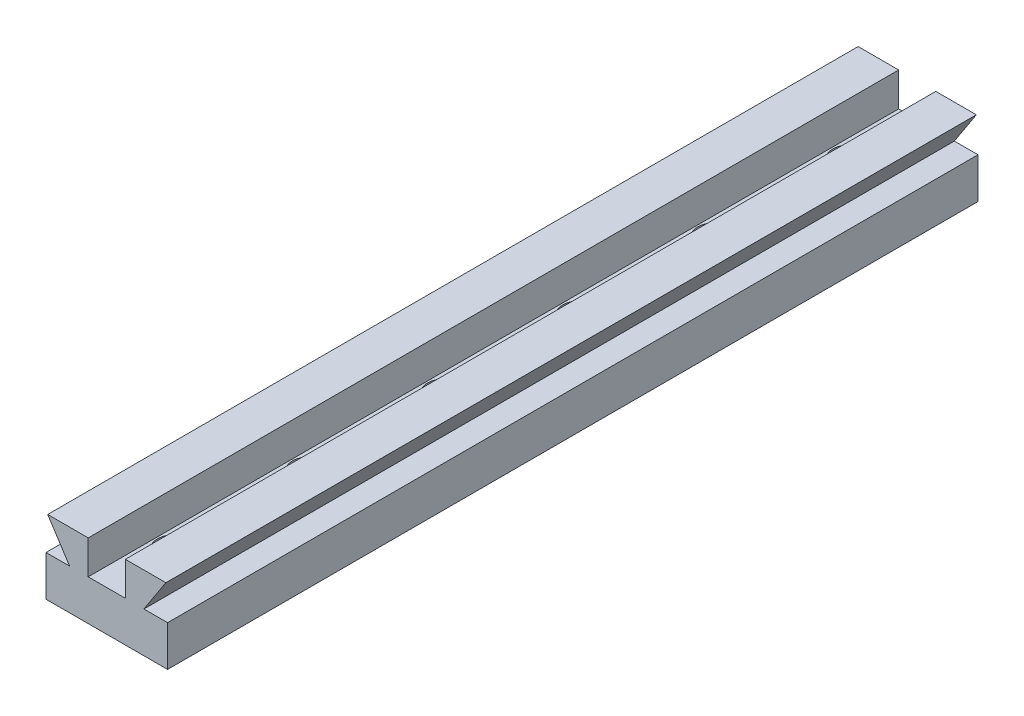
ISO-10303-21;
HEADER;
FILE_DESCRIPTION(('STEP AP214'),'2;1');
FILE_NAME('part.step','',(''),(''),'','','');
FILE_SCHEMA(('AUTOMOTIVE_DESIGN { 1 0 10303 214 1 1 1 1 }'));
ENDSEC;
DATA;
#1=APPLICATION_CONTEXT('core data for automotive mechanical design processes');
#2=APPLICATION_PROTOCOL_DEFINITION('international standard','automotive_design',2000,#1);
#3=PRODUCT_CONTEXT('',#1,'mechanical');
#4=PRODUCT('Part','Part','',(#3));
#5=PRODUCT_RELATED_PRODUCT_CATEGORY('part','',(#4));
#6=PRODUCT_DEFINITION_FORMATION('','',#4);
#7=PRODUCT_DEFINITION_CONTEXT('part definition',#1,'design');
#8=PRODUCT_DEFINITION('design','',#6,#7);
#9=PRODUCT_DEFINITION_SHAPE('','',#8);
#10=(LENGTH_UNIT() NAMED_UNIT(*) SI_UNIT(.MILLI.,.METRE.));
#11=(NAMED_UNIT(*) PLANE_ANGLE_UNIT() SI_UNIT($,.RADIAN.));
#12=(NAMED_UNIT(*) SI_UNIT($,.STERADIAN.) SOLID_ANGLE_UNIT());
#13=UNCERTAINTY_MEASURE_WITH_UNIT(LENGTH_MEASURE(1.E-05),#10,'distance_accuracy_value','');
#14=(GEOMETRIC_REPRESENTATION_CONTEXT(3) GLOBAL_UNCERTAINTY_ASSIGNED_CONTEXT((#13)) GLOBAL_UNIT_ASSIGNED_CONTEXT((#10,
#11,#12)) REPRESENTATION_CONTEXT('',''));
#15=CARTESIAN_POINT('',(0.,0.,0.));
#16=DIRECTION('',(0.,0.,1.));
#17=DIRECTION('',(1.,0.,0.));
#18=AXIS2_PLACEMENT_3D('',#15,#16,#17);
#19=CARTESIAN_POINT('',(-6.35016286644951,-3.58631921824104,120.));
#20=DIRECTION('',(0.838443616300637,0.544988350595414,0.));
#21=DIRECTION('',(-0.544988350595414,0.838443616300637,0.));
#22=AXIS2_PLACEMENT_3D('',#19,#20,#21);
#23=PLANE('',#22);
#24=DIRECTION('',(0.544988350595414,-0.838443616300637,0.));
#25=VECTOR('',#24,1.);
#26=CARTESIAN_POINT('',(-6.35016286644951,-3.58631921824104,0.));
#27=LINE('',#26,#25);
#28=CARTESIAN_POINT('',(-9.60016286644951,1.41368078175896,0.));
#29=VERTEX_POINT('',#28);
#30=CARTESIAN_POINT('',(-6.35016286644951,-3.58631921824104,0.));
#31=VERTEX_POINT('',#30);
#32=EDGE_CURVE('E153',#29,#31,#27,.T.);
#33=ORIENTED_EDGE('',*,*,#32,.T.);
#34=DIRECTION('',(0.,0.,-1.));
#35=VECTOR('',#34,1.);
#36=CARTESIAN_POINT('',(-6.35016286644951,-3.58631921824104,120.));
#37=LINE('',#36,#35);
#38=CARTESIAN_POINT('',(-6.35016286644951,-3.58631921824104,120.));
#39=VERTEX_POINT('',#38);
#40=EDGE_CURVE('E11',#39,#31,#37,.T.);
#41=ORIENTED_EDGE('',*,*,#40,.F.);
#42=DIRECTION('',(0.544988350595414,-0.838443616300637,0.));
#43=VECTOR('',#42,1.);
#44=CARTESIAN_POINT('',(-6.35016286644951,-3.58631921824104,120.));
#45=LINE('',#44,#43);
#46=CARTESIAN_POINT('',(-9.60016286644951,1.41368078175896,120.));
#47=VERTEX_POINT('',#46);
#48=EDGE_CURVE('E176',#47,#39,#45,.T.);
#49=ORIENTED_EDGE('',*,*,#48,.F.);
#50=DIRECTION('',(0.,0.,-1.));
#51=VECTOR('',#50,1.);
#52=CARTESIAN_POINT('',(-9.60016286644951,1.41368078175896,120.));
#53=LINE('',#52,#51);
#54=EDGE_CURVE('E149',#47,#29,#53,.T.);
#55=ORIENTED_EDGE('',*,*,#54,.T.);
#56=EDGE_LOOP('',(#33,#41,#49,#55));
#57=FACE_BOUND('',#56,.T.);
#58=ADVANCED_FACE('F33',(#57),#23,.F.);
#59=CARTESIAN_POINT('',(-9.85016286644951,-3.58631921824104,120.));
#60=DIRECTION('',(0.,-1.,0.));
#61=DIRECTION('',(1.,0.,0.));
#62=AXIS2_PLACEMENT_3D('',#59,#60,#61);
#63=PLANE('',#62);
#64=DIRECTION('',(-1.,0.,0.));
#65=VECTOR('',#64,1.);
#66=CARTESIAN_POINT('',(-9.85016286644951,-3.58631921824104,0.));
#67=LINE('',#66,#65);
#68=CARTESIAN_POINT('',(-9.85016286644951,-3.58631921824104,0.));
#69=VERTEX_POINT('',#68);
#70=EDGE_CURVE('E156',#31,#69,#67,.T.);
#71=ORIENTED_EDGE('',*,*,#70,.T.);
#72=DIRECTION('',(0.,0.,-1.));
#73=VECTOR('',#72,1.);
#74=CARTESIAN_POINT('',(-9.85016286644951,-3.58631921824104,120.));
#75=LINE('',#74,#73);
#76=CARTESIAN_POINT('',(-9.85016286644951,-3.58631921824104,120.));
#77=VERTEX_POINT('',#76);
#78=EDGE_CURVE('E41',#77,#69,#75,.T.);
#79=ORIENTED_EDGE('',*,*,#78,.F.);
#80=DIRECTION('',(-1.,0.,0.));
#81=VECTOR('',#80,1.);
#82=CARTESIAN_POINT('',(-9.85016286644951,-3.58631921824104,120.));
#83=LINE('',#82,#81);
#84=EDGE_CURVE('E104',#39,#77,#83,.T.);
#85=ORIENTED_EDGE('',*,*,#84,.F.);
#86=ORIENTED_EDGE('',*,*,#40,.T.);
#87=EDGE_LOOP('',(#71,#79,#85,#86));
#88=FACE_BOUND('',#87,.T.);
#89=ADVANCED_FACE('F254',(#88),#63,.F.);
#90=CARTESIAN_POINT('',(-9.85016286644951,-9.58631921824104,120.));
#91=DIRECTION('',(1.,0.,0.));
#92=DIRECTION('',(0.,0.,-1.));
#93=AXIS2_PLACEMENT_3D('',#90,#91,#92);
#94=PLANE('',#93);
#95=DIRECTION('',(0.,-1.,0.));
#96=VECTOR('',#95,1.);
#97=CARTESIAN_POINT('',(-9.85016286644951,-9.58631921824104,0.));
#98=LINE('',#97,#96);
#99=CARTESIAN_POINT('',(-9.85016286644951,-9.58631921824104,0.));
#100=VERTEX_POINT('',#99);
#101=EDGE_CURVE('E159',#69,#100,#98,.T.);
#102=ORIENTED_EDGE('',*,*,#101,.T.);
#103=DIRECTION('',(0.,0.,-1.));
#104=VECTOR('',#103,1.);
#105=CARTESIAN_POINT('',(-9.85016286644951,-9.58631921824104,120.));
#106=LINE('',#105,#104);
#107=CARTESIAN_POINT('',(-9.85016286644951,-9.58631921824104,120.));
#108=VERTEX_POINT('',#107);
#109=EDGE_CURVE('E195',#108,#100,#106,.T.);
#110=ORIENTED_EDGE('',*,*,#109,.F.);
#111=DIRECTION('',(0.,-1.,0.));
#112=VECTOR('',#111,1.);
#113=CARTESIAN_POINT('',(-9.85016286644951,-9.58631921824104,120.));
#114=LINE('',#113,#112);
#115=EDGE_CURVE('E203',#77,#108,#114,.T.);
#116=ORIENTED_EDGE('',*,*,#115,.F.);
#117=ORIENTED_EDGE('',*,*,#78,.T.);
#118=EDGE_LOOP('',(#102,#110,#116,#117));
#119=FACE_BOUND('',#118,.T.);
#120=ADVANCED_FACE('F201',(#119),#94,.F.);
#121=CARTESIAN_POINT('',(8.14983713355049,-9.58631921824104,120.));
#122=DIRECTION('',(0.,1.,0.));
#123=DIRECTION('',(0.,0.,1.));
#124=AXIS2_PLACEMENT_3D('',#121,#122,#123);
#125=PLANE('',#124);
#126=CARTESIAN_POINT('',(-0.850162866449506,-9.58631921824104,30.));
#127=DIRECTION('',(0.,1.,0.));
#128=DIRECTION('',(0.,0.,1.));
#129=AXIS2_PLACEMENT_3D('',#126,#127,#128);
#130=CIRCLE('',#129,1.5);
#131=CARTESIAN_POINT('',(-0.850162866449506,-9.58631921824104,31.5));
#132=VERTEX_POINT('',#131);
#133=EDGE_CURVE('E338',#132,#132,#130,.T.);
#134=ORIENTED_EDGE('',*,*,#133,.T.);
#135=EDGE_LOOP('',(#134));
#136=FACE_BOUND('',#135,.T.);
#137=CARTESIAN_POINT('',(-0.850162866449506,-9.58631921824104,50.));
#138=DIRECTION('',(0.,1.,0.));
#139=DIRECTION('',(0.,0.,1.));
#140=AXIS2_PLACEMENT_3D('',#137,#138,#139);
#141=CIRCLE('',#140,1.5);
#142=CARTESIAN_POINT('',(-0.850162866449506,-9.58631921824104,51.5));
#143=VERTEX_POINT('',#142);
#144=EDGE_CURVE('E362',#143,#143,#141,.T.);
#145=ORIENTED_EDGE('',*,*,#144,.T.);
#146=EDGE_LOOP('',(#145));
#147=FACE_BOUND('',#146,.T.);
#148=CARTESIAN_POINT('',(-0.850162866449506,-9.58631921824104,70.));
#149=DIRECTION('',(0.,1.,0.));
#150=DIRECTION('',(0.,0.,1.));
#151=AXIS2_PLACEMENT_3D('',#148,#149,#150);
#152=CIRCLE('',#151,1.5);
#153=CARTESIAN_POINT('',(-0.850162866449506,-9.58631921824104,71.5));
#154=VERTEX_POINT('',#153);
#155=EDGE_CURVE('E356',#154,#154,#152,.T.);
#156=ORIENTED_EDGE('',*,*,#155,.T.);
#157=EDGE_LOOP('',(#156));
#158=FACE_BOUND('',#157,.T.);
#159=CARTESIAN_POINT('',(-0.850162866449506,-9.58631921824104,90.));
#160=DIRECTION('',(0.,1.,0.));
#161=DIRECTION('',(0.,0.,1.));
#162=AXIS2_PLACEMENT_3D('',#159,#160,#161);
#163=CIRCLE('',#162,1.5);
#164=CARTESIAN_POINT('',(-0.850162866449506,-9.58631921824104,91.5));
#165=VERTEX_POINT('',#164);
#166=EDGE_CURVE('E350',#165,#165,#163,.T.);
#167=ORIENTED_EDGE('',*,*,#166,.T.);
#168=EDGE_LOOP('',(#167));
#169=FACE_BOUND('',#168,.T.);
#170=CARTESIAN_POINT('',(-0.850162866449506,-9.58631921824104,110.));
#171=DIRECTION('',(0.,1.,0.));
#172=DIRECTION('',(0.,0.,1.));
#173=AXIS2_PLACEMENT_3D('',#170,#171,#172);
#174=CIRCLE('',#173,1.5);
#175=CARTESIAN_POINT('',(-0.850162866449506,-9.58631921824104,111.5));
#176=VERTEX_POINT('',#175);
#177=EDGE_CURVE('E344',#176,#176,#174,.T.);
#178=ORIENTED_EDGE('',*,*,#177,.T.);
#179=EDGE_LOOP('',(#178));
#180=FACE_BOUND('',#179,.T.);
#181=CARTESIAN_POINT('',(-0.850162866449506,-9.58631921824104,10.));
#182=DIRECTION('',(0.,1.,0.));
#183=DIRECTION('',(0.,0.,1.));
#184=AXIS2_PLACEMENT_3D('',#181,#182,#183);
#185=CIRCLE('',#184,1.5);
#186=CARTESIAN_POINT('',(-0.850162866449506,-9.58631921824104,11.5));
#187=VERTEX_POINT('',#186);
#188=EDGE_CURVE('E319',#187,#187,#185,.T.);
#189=ORIENTED_EDGE('',*,*,#188,.T.);
#190=EDGE_LOOP('',(#189));
#191=FACE_BOUND('',#190,.T.);
#192=DIRECTION('',(1.,0.,0.));
#193=VECTOR('',#192,1.);
#194=CARTESIAN_POINT('',(8.14983713355049,-9.58631921824104,0.));
#195=LINE('',#194,#193);
#196=CARTESIAN_POINT('',(8.14983713355049,-9.58631921824104,0.));
#197=VERTEX_POINT('',#196);
#198=EDGE_CURVE('E161',#100,#197,#195,.T.);
#199=ORIENTED_EDGE('',*,*,#198,.T.);
#200=DIRECTION('',(0.,0.,-1.));
#201=VECTOR('',#200,1.);
#202=CARTESIAN_POINT('',(8.14983713355049,-9.58631921824104,120.));
#203=LINE('',#202,#201);
#204=CARTESIAN_POINT('',(8.14983713355049,-9.58631921824104,120.));
#205=VERTEX_POINT('',#204);
#206=EDGE_CURVE('E192',#205,#197,#203,.T.);
#207=ORIENTED_EDGE('',*,*,#206,.F.);
#208=DIRECTION('',(1.,0.,0.));
#209=VECTOR('',#208,1.);
#210=CARTESIAN_POINT('',(8.14983713355049,-9.58631921824104,120.));
#211=LINE('',#210,#209);
#212=EDGE_CURVE('E221',#108,#205,#211,.T.);
#213=ORIENTED_EDGE('',*,*,#212,.F.);
#214=ORIENTED_EDGE('',*,*,#109,.T.);
#215=EDGE_LOOP('',(#199,#207,#213,#214));
#216=FACE_BOUND('',#215,.T.);
#217=ADVANCED_FACE('F212',(#136,#147,#158,#169,#180,#191,#216),#125,.F.);
#218=CARTESIAN_POINT('',(8.14983713355049,-3.58631921824104,120.));
#219=DIRECTION('',(-1.,0.,0.));
#220=DIRECTION('',(0.,0.,1.));
#221=AXIS2_PLACEMENT_3D('',#218,#219,#220);
#222=PLANE('',#221);
#223=DIRECTION('',(0.,1.,0.));
#224=VECTOR('',#223,1.);
#225=CARTESIAN_POINT('',(8.14983713355049,-3.58631921824104,0.));
#226=LINE('',#225,#224);
#227=CARTESIAN_POINT('',(8.14983713355049,-3.58631921824104,0.));
#228=VERTEX_POINT('',#227);
#229=EDGE_CURVE('E163',#197,#228,#226,.T.);
#230=ORIENTED_EDGE('',*,*,#229,.T.);
#231=DIRECTION('',(0.,0.,-1.));
#232=VECTOR('',#231,1.);
#233=CARTESIAN_POINT('',(8.14983713355049,-3.58631921824104,120.));
#234=LINE('',#233,#232);
#235=CARTESIAN_POINT('',(8.14983713355049,-3.58631921824104,120.));
#236=VERTEX_POINT('',#235);
#237=EDGE_CURVE('E189',#236,#228,#234,.T.);
#238=ORIENTED_EDGE('',*,*,#237,.F.);
#239=DIRECTION('',(0.,1.,0.));
#240=VECTOR('',#239,1.);
#241=CARTESIAN_POINT('',(8.14983713355049,-3.58631921824104,120.));
#242=LINE('',#241,#240);
#243=EDGE_CURVE('E218',#205,#236,#242,.T.);
#244=ORIENTED_EDGE('',*,*,#243,.F.);
#245=ORIENTED_EDGE('',*,*,#206,.T.);
#246=EDGE_LOOP('',(#230,#238,#244,#245));
#247=FACE_BOUND('',#246,.T.);
#248=ADVANCED_FACE('F216',(#247),#222,.F.);
#249=CARTESIAN_POINT('',(4.64983713355049,-3.58631921824104,120.));
#250=DIRECTION('',(0.,-1.,0.));
#251=DIRECTION('',(0.,0.,-1.));
#252=AXIS2_PLACEMENT_3D('',#249,#250,#251);
#253=PLANE('',#252);
#254=DIRECTION('',(-1.,0.,0.));
#255=VECTOR('',#254,1.);
#256=CARTESIAN_POINT('',(4.64983713355049,-3.58631921824104,0.));
#257=LINE('',#256,#255);
#258=CARTESIAN_POINT('',(4.64983713355049,-3.58631921824104,0.));
#259=VERTEX_POINT('',#258);
#260=EDGE_CURVE('E165',#228,#259,#257,.T.);
#261=ORIENTED_EDGE('',*,*,#260,.T.);
#262=DIRECTION('',(0.,0.,-1.));
#263=VECTOR('',#262,1.);
#264=CARTESIAN_POINT('',(4.64983713355049,-3.58631921824104,120.));
#265=LINE('',#264,#263);
#266=CARTESIAN_POINT('',(4.64983713355049,-3.58631921824104,120.));
#267=VERTEX_POINT('',#266);
#268=EDGE_CURVE('E186',#267,#259,#265,.T.);
#269=ORIENTED_EDGE('',*,*,#268,.F.);
#270=DIRECTION('',(-1.,0.,0.));
#271=VECTOR('',#270,1.);
#272=CARTESIAN_POINT('',(4.64983713355049,-3.58631921824104,120.));
#273=LINE('',#272,#271);
#274=EDGE_CURVE('E220',#236,#267,#273,.T.);
#275=ORIENTED_EDGE('',*,*,#274,.F.);
#276=ORIENTED_EDGE('',*,*,#237,.T.);
#277=EDGE_LOOP('',(#261,#269,#275,#276));
#278=FACE_BOUND('',#277,.T.);
#279=ADVANCED_FACE('F268',(#278),#253,.F.);
#280=CARTESIAN_POINT('',(7.89983713355049,1.41368078175896,120.));
#281=DIRECTION('',(-0.838443616300637,0.544988350595414,0.));
#282=DIRECTION('',(-0.544988350595414,-0.838443616300637,0.));
#283=AXIS2_PLACEMENT_3D('',#280,#281,#282);
#284=PLANE('',#283);
#285=DIRECTION('',(0.544988350595414,0.838443616300637,0.));
#286=VECTOR('',#285,1.);
#287=CARTESIAN_POINT('',(7.89983713355049,1.41368078175896,0.));
#288=LINE('',#287,#286);
#289=CARTESIAN_POINT('',(7.89983713355049,1.41368078175896,0.));
#290=VERTEX_POINT('',#289);
#291=EDGE_CURVE('E167',#259,#290,#288,.T.);
#292=ORIENTED_EDGE('',*,*,#291,.T.);
#293=DIRECTION('',(0.,0.,-1.));
#294=VECTOR('',#293,1.);
#295=CARTESIAN_POINT('',(7.89983713355049,1.41368078175896,120.));
#296=LINE('',#295,#294);
#297=CARTESIAN_POINT('',(7.89983713355049,1.41368078175896,120.));
#298=VERTEX_POINT('',#297);
#299=EDGE_CURVE('E183',#298,#290,#296,.T.);
#300=ORIENTED_EDGE('',*,*,#299,.F.);
#301=DIRECTION('',(0.544988350595414,0.838443616300637,0.));
#302=VECTOR('',#301,1.);
#303=CARTESIAN_POINT('',(7.89983713355049,1.41368078175896,120.));
#304=LINE('',#303,#302);
#305=EDGE_CURVE('E223',#267,#298,#304,.T.);
#306=ORIENTED_EDGE('',*,*,#305,.F.);
#307=ORIENTED_EDGE('',*,*,#268,.T.);
#308=EDGE_LOOP('',(#292,#300,#306,#307));
#309=FACE_BOUND('',#308,.T.);
#310=ADVANCED_FACE('F271',(#309),#284,.F.);
#311=CARTESIAN_POINT('',(1.89983713355049,1.41368078175896,120.));
#312=DIRECTION('',(0.,-1.,0.));
#313=DIRECTION('',(0.,0.,-1.));
#314=AXIS2_PLACEMENT_3D('',#311,#312,#313);
#315=PLANE('',#314);
#316=DIRECTION('',(-1.,0.,0.));
#317=VECTOR('',#316,1.);
#318=CARTESIAN_POINT('',(1.89983713355049,1.41368078175896,0.));
#319=LINE('',#318,#317);
#320=CARTESIAN_POINT('',(1.89983713355049,1.41368078175896,0.));
#321=VERTEX_POINT('',#320);
#322=EDGE_CURVE('E169',#290,#321,#319,.T.);
#323=ORIENTED_EDGE('',*,*,#322,.T.);
#324=DIRECTION('',(0.,0.,-1.));
#325=VECTOR('',#324,1.);
#326=CARTESIAN_POINT('',(1.89983713355049,1.41368078175896,120.));
#327=LINE('',#326,#325);
#328=CARTESIAN_POINT('',(1.89983713355049,1.41368078175896,120.));
#329=VERTEX_POINT('',#328);
#330=EDGE_CURVE('E180',#329,#321,#327,.T.);
#331=ORIENTED_EDGE('',*,*,#330,.F.);
#332=DIRECTION('',(-1.,0.,0.));
#333=VECTOR('',#332,1.);
#334=CARTESIAN_POINT('',(1.89983713355049,1.41368078175896,120.));
#335=LINE('',#334,#333);
#336=EDGE_CURVE('E229',#298,#329,#335,.T.);
#337=ORIENTED_EDGE('',*,*,#336,.F.);
#338=ORIENTED_EDGE('',*,*,#299,.T.);
#339=EDGE_LOOP('',(#323,#331,#337,#338));
#340=FACE_BOUND('',#339,.T.);
#341=ADVANCED_FACE('F235',(#340),#315,.F.);
#342=CARTESIAN_POINT('',(1.89983713355049,-3.58631921824104,120.));
#343=DIRECTION('',(1.,0.,0.));
#344=DIRECTION('',(0.,1.,0.));
#345=AXIS2_PLACEMENT_3D('',#342,#343,#344);
#346=PLANE('',#345);
#347=DIRECTION('',(0.,-1.,0.));
#348=VECTOR('',#347,1.);
#349=CARTESIAN_POINT('',(1.89983713355049,-3.58631921824104,0.));
#350=LINE('',#349,#348);
#351=CARTESIAN_POINT('',(1.89983713355049,-3.58631921824104,0.));
#352=VERTEX_POINT('',#351);
#353=EDGE_CURVE('E171',#321,#352,#350,.T.);
#354=ORIENTED_EDGE('',*,*,#353,.T.);
#355=DIRECTION('',(0.,0.,-1.));
#356=VECTOR('',#355,1.);
#357=CARTESIAN_POINT('',(1.89983713355049,-3.58631921824104,120.));
#358=LINE('',#357,#356);
#359=CARTESIAN_POINT('',(1.89983713355049,-3.58631921824104,120.));
#360=VERTEX_POINT('',#359);
#361=EDGE_CURVE('E144',#360,#352,#358,.T.);
#362=ORIENTED_EDGE('',*,*,#361,.F.);
#363=DIRECTION('',(0.,-1.,0.));
#364=VECTOR('',#363,1.);
#365=CARTESIAN_POINT('',(1.89983713355049,-3.58631921824104,120.));
#366=LINE('',#365,#364);
#367=EDGE_CURVE('E135',#329,#360,#366,.T.);
#368=ORIENTED_EDGE('',*,*,#367,.F.);
#369=ORIENTED_EDGE('',*,*,#330,.T.);
#370=EDGE_LOOP('',(#354,#362,#368,#369));
#371=FACE_BOUND('',#370,.T.);
#372=ADVANCED_FACE('F239',(#371),#346,.F.);
#373=CARTESIAN_POINT('',(-3.60016286644951,-3.58631921824104,120.));
#374=DIRECTION('',(0.,-1.,0.));
#375=DIRECTION('',(0.,0.,-1.));
#376=AXIS2_PLACEMENT_3D('',#373,#374,#375);
#377=PLANE('',#376);
#378=CARTESIAN_POINT('',(-0.850162866449506,-3.58631921824104,30.));
#379=DIRECTION('',(0.,1.,0.));
#380=DIRECTION('',(0.,0.,1.));
#381=AXIS2_PLACEMENT_3D('',#378,#379,#380);
#382=CIRCLE('',#381,2.5);
#383=CARTESIAN_POINT('',(-0.850162866449506,-3.58631921824104,32.5));
#384=VERTEX_POINT('',#383);
#385=EDGE_CURVE('E287',#384,#384,#382,.T.);
#386=ORIENTED_EDGE('',*,*,#385,.F.);
#387=EDGE_LOOP('',(#386));
#388=FACE_BOUND('',#387,.T.);
#389=CARTESIAN_POINT('',(-0.850162866449506,-3.58631921824104,50.));
#390=DIRECTION('',(0.,1.,0.));
#391=DIRECTION('',(0.,0.,1.));
#392=AXIS2_PLACEMENT_3D('',#389,#390,#391);
#393=CIRCLE('',#392,2.5);
#394=CARTESIAN_POINT('',(-0.850162866449506,-3.58631921824104,52.5));
#395=VERTEX_POINT('',#394);
#396=EDGE_CURVE('E291',#395,#395,#393,.T.);
#397=ORIENTED_EDGE('',*,*,#396,.F.);
#398=EDGE_LOOP('',(#397));
#399=FACE_BOUND('',#398,.T.);
#400=CARTESIAN_POINT('',(-0.850162866449506,-3.58631921824104,70.));
#401=DIRECTION('',(0.,1.,0.));
#402=DIRECTION('',(0.,0.,1.));
#403=AXIS2_PLACEMENT_3D('',#400,#401,#402);
#404=CIRCLE('',#403,2.5);
#405=CARTESIAN_POINT('',(-0.850162866449506,-3.58631921824104,72.5));
#406=VERTEX_POINT('',#405);
#407=EDGE_CURVE('E295',#406,#406,#404,.T.);
#408=ORIENTED_EDGE('',*,*,#407,.F.);
#409=EDGE_LOOP('',(#408));
#410=FACE_BOUND('',#409,.T.);
#411=CARTESIAN_POINT('',(-0.850162866449506,-3.58631921824104,90.));
#412=DIRECTION('',(0.,1.,0.));
#413=DIRECTION('',(0.,0.,1.));
#414=AXIS2_PLACEMENT_3D('',#411,#412,#413);
#415=CIRCLE('',#414,2.5);
#416=CARTESIAN_POINT('',(-0.850162866449506,-3.58631921824104,92.5));
#417=VERTEX_POINT('',#416);
#418=EDGE_CURVE('E299',#417,#417,#415,.T.);
#419=ORIENTED_EDGE('',*,*,#418,.F.);
#420=EDGE_LOOP('',(#419));
#421=FACE_BOUND('',#420,.T.);
#422=CARTESIAN_POINT('',(-0.850162866449506,-3.58631921824104,110.));
#423=DIRECTION('',(0.,1.,0.));
#424=DIRECTION('',(0.,0.,1.));
#425=AXIS2_PLACEMENT_3D('',#422,#423,#424);
#426=CIRCLE('',#425,2.5);
#427=CARTESIAN_POINT('',(-0.850162866449506,-3.58631921824104,112.5));
#428=VERTEX_POINT('',#427);
#429=EDGE_CURVE('E303',#428,#428,#426,.T.);
#430=ORIENTED_EDGE('',*,*,#429,.F.);
#431=EDGE_LOOP('',(#430));
#432=FACE_BOUND('',#431,.T.);
#433=CARTESIAN_POINT('',(-0.850162866449506,-3.58631921824104,10.));
#434=DIRECTION('',(0.,1.,0.));
#435=DIRECTION('',(0.,0.,1.));
#436=AXIS2_PLACEMENT_3D('',#433,#434,#435);
#437=CIRCLE('',#436,2.5);
#438=CARTESIAN_POINT('',(-0.850162866449506,-3.58631921824104,12.5));
#439=VERTEX_POINT('',#438);
#440=EDGE_CURVE('E306',#439,#439,#437,.T.);
#441=ORIENTED_EDGE('',*,*,#440,.F.);
#442=EDGE_LOOP('',(#441));
#443=FACE_BOUND('',#442,.T.);
#444=DIRECTION('',(-1.,0.,0.));
#445=VECTOR('',#444,1.);
#446=CARTESIAN_POINT('',(-3.60016286644951,-3.58631921824104,0.));
#447=LINE('',#446,#445);
#448=CARTESIAN_POINT('',(-3.60016286644951,-3.58631921824104,0.));
#449=VERTEX_POINT('',#448);
#450=EDGE_CURVE('E143',#352,#449,#447,.T.);
#451=ORIENTED_EDGE('',*,*,#450,.T.);
#452=DIRECTION('',(0.,0.,-1.));
#453=VECTOR('',#452,1.);
#454=CARTESIAN_POINT('',(-3.60016286644951,-3.58631921824104,120.));
#455=LINE('',#454,#453);
#456=CARTESIAN_POINT('',(-3.60016286644951,-3.58631921824104,120.));
#457=VERTEX_POINT('',#456);
#458=EDGE_CURVE('E140',#457,#449,#455,.T.);
#459=ORIENTED_EDGE('',*,*,#458,.F.);
#460=DIRECTION('',(-1.,0.,0.));
#461=VECTOR('',#460,1.);
#462=CARTESIAN_POINT('',(-3.60016286644951,-3.58631921824104,120.));
#463=LINE('',#462,#461);
#464=EDGE_CURVE('E129',#360,#457,#463,.T.);
#465=ORIENTED_EDGE('',*,*,#464,.F.);
#466=ORIENTED_EDGE('',*,*,#361,.T.);
#467=EDGE_LOOP('',(#451,#459,#465,#466));
#468=FACE_BOUND('',#467,.T.);
#469=ADVANCED_FACE('F141',(#388,#399,#410,#421,#432,#443,#468),#377,.F.);
#470=CARTESIAN_POINT('',(-3.60016286644951,1.41368078175896,120.));
#471=DIRECTION('',(-1.,0.,0.));
#472=DIRECTION('',(0.,-1.,0.));
#473=AXIS2_PLACEMENT_3D('',#470,#471,#472);
#474=PLANE('',#473);
#475=DIRECTION('',(0.,1.,0.));
#476=VECTOR('',#475,1.);
#477=CARTESIAN_POINT('',(-3.60016286644951,1.41368078175896,0.));
#478=LINE('',#477,#476);
#479=CARTESIAN_POINT('',(-3.60016286644951,1.41368078175896,0.));
#480=VERTEX_POINT('',#479);
#481=EDGE_CURVE('E90',#449,#480,#478,.T.);
#482=ORIENTED_EDGE('',*,*,#481,.T.);
#483=DIRECTION('',(0.,0.,-1.));
#484=VECTOR('',#483,1.);
#485=CARTESIAN_POINT('',(-3.60016286644951,1.41368078175896,120.));
#486=LINE('',#485,#484);
#487=CARTESIAN_POINT('',(-3.60016286644951,1.41368078175896,120.));
#488=VERTEX_POINT('',#487);
#489=EDGE_CURVE('E145',#488,#480,#486,.T.);
#490=ORIENTED_EDGE('',*,*,#489,.F.);
#491=DIRECTION('',(0.,1.,0.));
#492=VECTOR('',#491,1.);
#493=CARTESIAN_POINT('',(-3.60016286644951,1.41368078175896,120.));
#494=LINE('',#493,#492);
#495=EDGE_CURVE('E133',#457,#488,#494,.T.);
#496=ORIENTED_EDGE('',*,*,#495,.F.);
#497=ORIENTED_EDGE('',*,*,#458,.T.);
#498=EDGE_LOOP('',(#482,#490,#496,#497));
#499=FACE_BOUND('',#498,.T.);
#500=ADVANCED_FACE('F147',(#499),#474,.F.);
#501=CARTESIAN_POINT('',(-9.60016286644951,1.41368078175896,120.));
#502=DIRECTION('',(0.,-1.,0.));
#503=DIRECTION('',(0.,0.,-1.));
#504=AXIS2_PLACEMENT_3D('',#501,#502,#503);
#505=PLANE('',#504);
#506=DIRECTION('',(-1.,0.,0.));
#507=VECTOR('',#506,1.);
#508=CARTESIAN_POINT('',(-9.60016286644951,1.41368078175896,0.));
#509=LINE('',#508,#507);
#510=EDGE_CURVE('E96',#480,#29,#509,.T.);
#511=ORIENTED_EDGE('',*,*,#510,.T.);
#512=ORIENTED_EDGE('',*,*,#54,.F.);
#513=DIRECTION('',(-1.,0.,0.));
#514=VECTOR('',#513,1.);
#515=CARTESIAN_POINT('',(-9.60016286644951,1.41368078175896,120.));
#516=LINE('',#515,#514);
#517=EDGE_CURVE('E49',#488,#47,#516,.T.);
#518=ORIENTED_EDGE('',*,*,#517,.F.);
#519=ORIENTED_EDGE('',*,*,#489,.T.);
#520=EDGE_LOOP('',(#511,#512,#518,#519));
#521=FACE_BOUND('',#520,.T.);
#522=ADVANCED_FACE('F243',(#521),#505,.F.);
#523=CARTESIAN_POINT('',(0.,0.,120.));
#524=DIRECTION('',(0.,0.,1.));
#525=DIRECTION('',(1.,0.,0.));
#526=AXIS2_PLACEMENT_3D('',#523,#524,#525);
#527=PLANE('',#526);
#528=ORIENTED_EDGE('',*,*,#48,.T.);
#529=ORIENTED_EDGE('',*,*,#84,.T.);
#530=ORIENTED_EDGE('',*,*,#115,.T.);
#531=ORIENTED_EDGE('',*,*,#212,.T.);
#532=ORIENTED_EDGE('',*,*,#243,.T.);
#533=ORIENTED_EDGE('',*,*,#274,.T.);
#534=ORIENTED_EDGE('',*,*,#305,.T.);
#535=ORIENTED_EDGE('',*,*,#336,.T.);
#536=ORIENTED_EDGE('',*,*,#367,.T.);
#537=ORIENTED_EDGE('',*,*,#464,.T.);
#538=ORIENTED_EDGE('',*,*,#495,.T.);
#539=ORIENTED_EDGE('',*,*,#517,.T.);
#540=EDGE_LOOP('',(#528,#529,#530,#531,#532,#533,#534,#535,#536,#537,#538,#539));
#541=FACE_BOUND('',#540,.T.);
#542=ADVANCED_FACE('F131',(#541),#527,.T.);
#543=CARTESIAN_POINT('',(0.,0.,0.));
#544=DIRECTION('',(0.,0.,1.));
#545=DIRECTION('',(1.,0.,0.));
#546=AXIS2_PLACEMENT_3D('',#543,#544,#545);
#547=PLANE('',#546);
#548=ORIENTED_EDGE('',*,*,#32,.F.);
#549=ORIENTED_EDGE('',*,*,#510,.F.);
#550=ORIENTED_EDGE('',*,*,#481,.F.);
#551=ORIENTED_EDGE('',*,*,#450,.F.);
#552=ORIENTED_EDGE('',*,*,#353,.F.);
#553=ORIENTED_EDGE('',*,*,#322,.F.);
#554=ORIENTED_EDGE('',*,*,#291,.F.);
#555=ORIENTED_EDGE('',*,*,#260,.F.);
#556=ORIENTED_EDGE('',*,*,#229,.F.);
#557=ORIENTED_EDGE('',*,*,#198,.F.);
#558=ORIENTED_EDGE('',*,*,#101,.F.);
#559=ORIENTED_EDGE('',*,*,#70,.F.);
#560=EDGE_LOOP('',(#548,#549,#550,#551,#552,#553,#554,#555,#556,#557,#558,#559));
#561=FACE_BOUND('',#560,.T.);
#562=ADVANCED_FACE('F207',(#561),#547,.F.);
#563=CARTESIAN_POINT('',(-0.850162866449506,-6.08631921824104,10.));
#564=DIRECTION('',(0.,1.,0.));
#565=DIRECTION('',(0.,0.,1.));
#566=AXIS2_PLACEMENT_3D('',#563,#564,#565);
#567=CYLINDRICAL_SURFACE('',#566,2.5);
#568=CARTESIAN_POINT('',(-0.850162866449506,-6.08631921824104,10.));
#569=DIRECTION('',(0.,1.,0.));
#570=DIRECTION('',(0.,0.,1.));
#571=AXIS2_PLACEMENT_3D('',#568,#569,#570);
#572=CIRCLE('',#571,2.5);
#573=CARTESIAN_POINT('',(-0.850162866449506,-6.08631921824104,12.5));
#574=VERTEX_POINT('',#573);
#575=EDGE_CURVE('E157',#574,#574,#572,.T.);
#576=ORIENTED_EDGE('',*,*,#575,.F.);
#577=EDGE_LOOP('',(#576));
#578=FACE_BOUND('',#577,.T.);
#579=ORIENTED_EDGE('',*,*,#440,.T.);
#580=EDGE_LOOP('',(#579));
#581=FACE_BOUND('',#580,.T.);
#582=ADVANCED_FACE('F429',(#578,#581),#567,.F.);
#583=CARTESIAN_POINT('',(-0.850162866449506,-6.08631921824104,10.));
#584=DIRECTION('',(0.,1.,0.));
#585=DIRECTION('',(0.,0.,1.));
#586=AXIS2_PLACEMENT_3D('',#583,#584,#585);
#587=PLANE('',#586);
#588=CARTESIAN_POINT('',(-0.850162866449506,-6.08631921824104,10.));
#589=DIRECTION('',(0.,1.,0.));
#590=DIRECTION('',(0.,0.,1.));
#591=AXIS2_PLACEMENT_3D('',#588,#589,#590);
#592=CIRCLE('',#591,1.5);
#593=CARTESIAN_POINT('',(-0.850162866449506,-6.08631921824104,11.5));
#594=VERTEX_POINT('',#593);
#595=EDGE_CURVE('E335',#594,#594,#592,.T.);
#596=ORIENTED_EDGE('',*,*,#595,.F.);
#597=EDGE_LOOP('',(#596));
#598=FACE_BOUND('',#597,.T.);
#599=ORIENTED_EDGE('',*,*,#575,.T.);
#600=EDGE_LOOP('',(#599));
#601=FACE_BOUND('',#600,.T.);
#602=ADVANCED_FACE('F425',(#598,#601),#587,.T.);
#603=CARTESIAN_POINT('',(-0.850162866449506,-6.08631921824104,110.));
#604=DIRECTION('',(0.,1.,0.));
#605=DIRECTION('',(0.,0.,1.));
#606=AXIS2_PLACEMENT_3D('',#603,#604,#605);
#607=CYLINDRICAL_SURFACE('',#606,2.5);
#608=CARTESIAN_POINT('',(-0.850162866449506,-6.08631921824104,110.));
#609=DIRECTION('',(0.,1.,0.));
#610=DIRECTION('',(0.,0.,1.));
#611=AXIS2_PLACEMENT_3D('',#608,#609,#610);
#612=CIRCLE('',#611,2.5);
#613=CARTESIAN_POINT('',(-0.850162866449506,-6.08631921824104,112.5));
#614=VERTEX_POINT('',#613);
#615=EDGE_CURVE('E318',#614,#614,#612,.T.);
#616=ORIENTED_EDGE('',*,*,#615,.F.);
#617=EDGE_LOOP('',(#616));
#618=FACE_BOUND('',#617,.T.);
#619=ORIENTED_EDGE('',*,*,#429,.T.);
#620=EDGE_LOOP('',(#619));
#621=FACE_BOUND('',#620,.T.);
#622=ADVANCED_FACE('F421',(#618,#621),#607,.F.);
#623=CARTESIAN_POINT('',(-0.850162866449506,-6.08631921824104,110.));
#624=DIRECTION('',(0.,1.,0.));
#625=DIRECTION('',(0.,0.,1.));
#626=AXIS2_PLACEMENT_3D('',#623,#624,#625);
#627=PLANE('',#626);
#628=CARTESIAN_POINT('',(-0.850162866449506,-6.08631921824104,110.));
#629=DIRECTION('',(0.,1.,0.));
#630=DIRECTION('',(0.,0.,1.));
#631=AXIS2_PLACEMENT_3D('',#628,#629,#630);
#632=CIRCLE('',#631,1.5);
#633=CARTESIAN_POINT('',(-0.850162866449506,-6.08631921824104,111.5));
#634=VERTEX_POINT('',#633);
#635=EDGE_CURVE('E341',#634,#634,#632,.T.);
#636=ORIENTED_EDGE('',*,*,#635,.F.);
#637=EDGE_LOOP('',(#636));
#638=FACE_BOUND('',#637,.T.);
#639=ORIENTED_EDGE('',*,*,#615,.T.);
#640=EDGE_LOOP('',(#639));
#641=FACE_BOUND('',#640,.T.);
#642=ADVANCED_FACE('F417',(#638,#641),#627,.T.);
#643=CARTESIAN_POINT('',(-0.850162866449506,-6.08631921824104,90.));
#644=DIRECTION('',(0.,1.,0.));
#645=DIRECTION('',(0.,0.,1.));
#646=AXIS2_PLACEMENT_3D('',#643,#644,#645);
#647=CYLINDRICAL_SURFACE('',#646,2.5);
#648=CARTESIAN_POINT('',(-0.850162866449506,-6.08631921824104,90.));
#649=DIRECTION('',(0.,1.,0.));
#650=DIRECTION('',(0.,0.,1.));
#651=AXIS2_PLACEMENT_3D('',#648,#649,#650);
#652=CIRCLE('',#651,2.5);
#653=CARTESIAN_POINT('',(-0.850162866449506,-6.08631921824104,92.5));
#654=VERTEX_POINT('',#653);
#655=EDGE_CURVE('E323',#654,#654,#652,.T.);
#656=ORIENTED_EDGE('',*,*,#655,.F.);
#657=EDGE_LOOP('',(#656));
#658=FACE_BOUND('',#657,.T.);
#659=ORIENTED_EDGE('',*,*,#418,.T.);
#660=EDGE_LOOP('',(#659));
#661=FACE_BOUND('',#660,.T.);
#662=ADVANCED_FACE('F413',(#658,#661),#647,.F.);
#663=CARTESIAN_POINT('',(-0.850162866449506,-6.08631921824104,90.));
#664=DIRECTION('',(0.,1.,0.));
#665=DIRECTION('',(0.,0.,1.));
#666=AXIS2_PLACEMENT_3D('',#663,#664,#665);
#667=PLANE('',#666);
#668=CARTESIAN_POINT('',(-0.850162866449506,-6.08631921824104,90.));
#669=DIRECTION('',(0.,1.,0.));
#670=DIRECTION('',(0.,0.,1.));
#671=AXIS2_PLACEMENT_3D('',#668,#669,#670);
#672=CIRCLE('',#671,1.5);
#673=CARTESIAN_POINT('',(-0.850162866449506,-6.08631921824104,91.5));
#674=VERTEX_POINT('',#673);
#675=EDGE_CURVE('E347',#674,#674,#672,.T.);
#676=ORIENTED_EDGE('',*,*,#675,.F.);
#677=EDGE_LOOP('',(#676));
#678=FACE_BOUND('',#677,.T.);
#679=ORIENTED_EDGE('',*,*,#655,.T.);
#680=EDGE_LOOP('',(#679));
#681=FACE_BOUND('',#680,.T.);
#682=ADVANCED_FACE('F409',(#678,#681),#667,.T.);
#683=CARTESIAN_POINT('',(-0.850162866449506,-6.08631921824104,70.));
#684=DIRECTION('',(0.,1.,0.));
#685=DIRECTION('',(0.,0.,1.));
#686=AXIS2_PLACEMENT_3D('',#683,#684,#685);
#687=CYLINDRICAL_SURFACE('',#686,2.5);
#688=CARTESIAN_POINT('',(-0.850162866449506,-6.08631921824104,70.));
#689=DIRECTION('',(0.,1.,0.));
#690=DIRECTION('',(0.,0.,1.));
#691=AXIS2_PLACEMENT_3D('',#688,#689,#690);
#692=CIRCLE('',#691,2.5);
#693=CARTESIAN_POINT('',(-0.850162866449506,-6.08631921824104,72.5));
#694=VERTEX_POINT('',#693);
#695=EDGE_CURVE('E327',#694,#694,#692,.T.);
#696=ORIENTED_EDGE('',*,*,#695,.F.);
#697=EDGE_LOOP('',(#696));
#698=FACE_BOUND('',#697,.T.);
#699=ORIENTED_EDGE('',*,*,#407,.T.);
#700=EDGE_LOOP('',(#699));
#701=FACE_BOUND('',#700,.T.);
#702=ADVANCED_FACE('F405',(#698,#701),#687,.F.);
#703=CARTESIAN_POINT('',(-0.850162866449506,-6.08631921824104,70.));
#704=DIRECTION('',(0.,1.,0.));
#705=DIRECTION('',(0.,0.,1.));
#706=AXIS2_PLACEMENT_3D('',#703,#704,#705);
#707=PLANE('',#706);
#708=CARTESIAN_POINT('',(-0.850162866449506,-6.08631921824104,70.));
#709=DIRECTION('',(0.,1.,0.));
#710=DIRECTION('',(0.,0.,1.));
#711=AXIS2_PLACEMENT_3D('',#708,#709,#710);
#712=CIRCLE('',#711,1.5);
#713=CARTESIAN_POINT('',(-0.850162866449506,-6.08631921824104,71.5));
#714=VERTEX_POINT('',#713);
#715=EDGE_CURVE('E353',#714,#714,#712,.T.);
#716=ORIENTED_EDGE('',*,*,#715,.F.);
#717=EDGE_LOOP('',(#716));
#718=FACE_BOUND('',#717,.T.);
#719=ORIENTED_EDGE('',*,*,#695,.T.);
#720=EDGE_LOOP('',(#719));
#721=FACE_BOUND('',#720,.T.);
#722=ADVANCED_FACE('F401',(#718,#721),#707,.T.);
#723=CARTESIAN_POINT('',(-0.850162866449506,-6.08631921824104,50.));
#724=DIRECTION('',(0.,1.,0.));
#725=DIRECTION('',(0.,0.,1.));
#726=AXIS2_PLACEMENT_3D('',#723,#724,#725);
#727=CYLINDRICAL_SURFACE('',#726,2.5);
#728=CARTESIAN_POINT('',(-0.850162866449506,-6.08631921824104,50.));
#729=DIRECTION('',(0.,1.,0.));
#730=DIRECTION('',(0.,0.,1.));
#731=AXIS2_PLACEMENT_3D('',#728,#729,#730);
#732=CIRCLE('',#731,2.5);
#733=CARTESIAN_POINT('',(-0.850162866449506,-6.08631921824104,52.5));
#734=VERTEX_POINT('',#733);
#735=EDGE_CURVE('E331',#734,#734,#732,.T.);
#736=ORIENTED_EDGE('',*,*,#735,.F.);
#737=EDGE_LOOP('',(#736));
#738=FACE_BOUND('',#737,.T.);
#739=ORIENTED_EDGE('',*,*,#396,.T.);
#740=EDGE_LOOP('',(#739));
#741=FACE_BOUND('',#740,.T.);
#742=ADVANCED_FACE('F394',(#738,#741),#727,.F.);
#743=CARTESIAN_POINT('',(-0.850162866449506,-6.08631921824104,50.));
#744=DIRECTION('',(0.,1.,0.));
#745=DIRECTION('',(0.,0.,1.));
#746=AXIS2_PLACEMENT_3D('',#743,#744,#745);
#747=PLANE('',#746);
#748=CARTESIAN_POINT('',(-0.850162866449506,-6.08631921824104,50.));
#749=DIRECTION('',(0.,1.,0.));
#750=DIRECTION('',(0.,0.,1.));
#751=AXIS2_PLACEMENT_3D('',#748,#749,#750);
#752=CIRCLE('',#751,1.5);
#753=CARTESIAN_POINT('',(-0.850162866449506,-6.08631921824104,51.5));
#754=VERTEX_POINT('',#753);
#755=EDGE_CURVE('E359',#754,#754,#752,.T.);
#756=ORIENTED_EDGE('',*,*,#755,.F.);
#757=EDGE_LOOP('',(#756));
#758=FACE_BOUND('',#757,.T.);
#759=ORIENTED_EDGE('',*,*,#735,.T.);
#760=EDGE_LOOP('',(#759));
#761=FACE_BOUND('',#760,.T.);
#762=ADVANCED_FACE('F389',(#758,#761),#747,.T.);
#763=CARTESIAN_POINT('',(-0.850162866449506,-6.08631921824104,30.));
#764=DIRECTION('',(0.,1.,0.));
#765=DIRECTION('',(0.,0.,1.));
#766=AXIS2_PLACEMENT_3D('',#763,#764,#765);
#767=CYLINDRICAL_SURFACE('',#766,2.5);
#768=CARTESIAN_POINT('',(-0.850162866449506,-6.08631921824104,30.));
#769=DIRECTION('',(0.,1.,0.));
#770=DIRECTION('',(0.,0.,1.));
#771=AXIS2_PLACEMENT_3D('',#768,#769,#770);
#772=CIRCLE('',#771,2.5);
#773=CARTESIAN_POINT('',(-0.850162866449506,-6.08631921824104,32.5));
#774=VERTEX_POINT('',#773);
#775=EDGE_CURVE('E308',#774,#774,#772,.T.);
#776=ORIENTED_EDGE('',*,*,#775,.F.);
#777=EDGE_LOOP('',(#776));
#778=FACE_BOUND('',#777,.T.);
#779=ORIENTED_EDGE('',*,*,#385,.T.);
#780=EDGE_LOOP('',(#779));
#781=FACE_BOUND('',#780,.T.);
#782=ADVANCED_FACE('F383',(#778,#781),#767,.F.);
#783=CARTESIAN_POINT('',(-0.850162866449506,-6.08631921824104,30.));
#784=DIRECTION('',(0.,1.,0.));
#785=DIRECTION('',(0.,0.,1.));
#786=AXIS2_PLACEMENT_3D('',#783,#784,#785);
#787=PLANE('',#786);
#788=CARTESIAN_POINT('',(-0.850162866449506,-6.08631921824104,30.));
#789=DIRECTION('',(0.,1.,0.));
#790=DIRECTION('',(0.,0.,1.));
#791=AXIS2_PLACEMENT_3D('',#788,#789,#790);
#792=CIRCLE('',#791,1.5);
#793=CARTESIAN_POINT('',(-0.850162866449506,-6.08631921824104,31.5));
#794=VERTEX_POINT('',#793);
#795=EDGE_CURVE('E365',#794,#794,#792,.T.);
#796=ORIENTED_EDGE('',*,*,#795,.F.);
#797=EDGE_LOOP('',(#796));
#798=FACE_BOUND('',#797,.T.);
#799=ORIENTED_EDGE('',*,*,#775,.T.);
#800=EDGE_LOOP('',(#799));
#801=FACE_BOUND('',#800,.T.);
#802=ADVANCED_FACE('F380',(#798,#801),#787,.T.);
#803=CARTESIAN_POINT('',(-0.850162866449506,-9.58631921824104,10.));
#804=DIRECTION('',(0.,1.,0.));
#805=DIRECTION('',(0.,0.,1.));
#806=AXIS2_PLACEMENT_3D('',#803,#804,#805);
#807=CYLINDRICAL_SURFACE('',#806,1.5);
#808=ORIENTED_EDGE('',*,*,#188,.F.);
#809=EDGE_LOOP('',(#808));
#810=FACE_BOUND('',#809,.T.);
#811=ORIENTED_EDGE('',*,*,#595,.T.);
#812=EDGE_LOOP('',(#811));
#813=FACE_BOUND('',#812,.T.);
#814=ADVANCED_FACE('F376',(#810,#813),#807,.F.);
#815=CARTESIAN_POINT('',(-0.850162866449506,-9.58631921824104,30.));
#816=DIRECTION('',(0.,1.,0.));
#817=DIRECTION('',(0.,0.,1.));
#818=AXIS2_PLACEMENT_3D('',#815,#816,#817);
#819=CYLINDRICAL_SURFACE('',#818,1.5);
#820=ORIENTED_EDGE('',*,*,#133,.F.);
#821=EDGE_LOOP('',(#820));
#822=FACE_BOUND('',#821,.T.);
#823=ORIENTED_EDGE('',*,*,#795,.T.);
#824=EDGE_LOOP('',(#823));
#825=FACE_BOUND('',#824,.T.);
#826=ADVANCED_FACE('F372',(#822,#825),#819,.F.);
#827=CARTESIAN_POINT('',(-0.850162866449506,-9.58631921824104,50.));
#828=DIRECTION('',(0.,1.,0.));
#829=DIRECTION('',(0.,0.,1.));
#830=AXIS2_PLACEMENT_3D('',#827,#828,#829);
#831=CYLINDRICAL_SURFACE('',#830,1.5);
#832=ORIENTED_EDGE('',*,*,#144,.F.);
#833=EDGE_LOOP('',(#832));
#834=FACE_BOUND('',#833,.T.);
#835=ORIENTED_EDGE('',*,*,#755,.T.);
#836=EDGE_LOOP('',(#835));
#837=FACE_BOUND('',#836,.T.);
#838=ADVANCED_FACE('F375',(#834,#837),#831,.F.);
#839=CARTESIAN_POINT('',(-0.850162866449506,-9.58631921824104,70.));
#840=DIRECTION('',(0.,1.,0.));
#841=DIRECTION('',(0.,0.,1.));
#842=AXIS2_PLACEMENT_3D('',#839,#840,#841);
#843=CYLINDRICAL_SURFACE('',#842,1.5);
#844=ORIENTED_EDGE('',*,*,#155,.F.);
#845=EDGE_LOOP('',(#844));
#846=FACE_BOUND('',#845,.T.);
#847=ORIENTED_EDGE('',*,*,#715,.T.);
#848=EDGE_LOOP('',(#847));
#849=FACE_BOUND('',#848,.T.);
#850=ADVANCED_FACE('F509',(#846,#849),#843,.F.);
#851=CARTESIAN_POINT('',(-0.850162866449506,-9.58631921824104,90.));
#852=DIRECTION('',(0.,1.,0.));
#853=DIRECTION('',(0.,0.,1.));
#854=AXIS2_PLACEMENT_3D('',#851,#852,#853);
#855=CYLINDRICAL_SURFACE('',#854,1.5);
#856=ORIENTED_EDGE('',*,*,#166,.F.);
#857=EDGE_LOOP('',(#856));
#858=FACE_BOUND('',#857,.T.);
#859=ORIENTED_EDGE('',*,*,#675,.T.);
#860=EDGE_LOOP('',(#859));
#861=FACE_BOUND('',#860,.T.);
#862=ADVANCED_FACE('F519',(#858,#861),#855,.F.);
#863=CARTESIAN_POINT('',(-0.850162866449506,-9.58631921824104,110.));
#864=DIRECTION('',(0.,1.,0.));
#865=DIRECTION('',(0.,0.,1.));
#866=AXIS2_PLACEMENT_3D('',#863,#864,#865);
#867=CYLINDRICAL_SURFACE('',#866,1.5);
#868=ORIENTED_EDGE('',*,*,#177,.F.);
#869=EDGE_LOOP('',(#868));
#870=FACE_BOUND('',#869,.T.);
#871=ORIENTED_EDGE('',*,*,#635,.T.);
#872=EDGE_LOOP('',(#871));
#873=FACE_BOUND('',#872,.T.);
#874=ADVANCED_FACE('F529',(#870,#873),#867,.F.);
#875=CLOSED_SHELL('',(#58,#89,#120,#217,#248,#279,#310,#341,#372,#469,#500,#522,#542,#562,#582,
#602,#622,#642,#662,#682,#702,#722,#742,#762,#782,#802,#814,#826,#838,#850,#862,#874));
#876=MANIFOLD_SOLID_BREP('B2',#875);
#877=ADVANCED_BREP_SHAPE_REPRESENTATION('',(#18,#876),#14);
#878=SHAPE_DEFINITION_REPRESENTATION(#9,#877);
ENDSEC;
END-ISO-10303-21;
